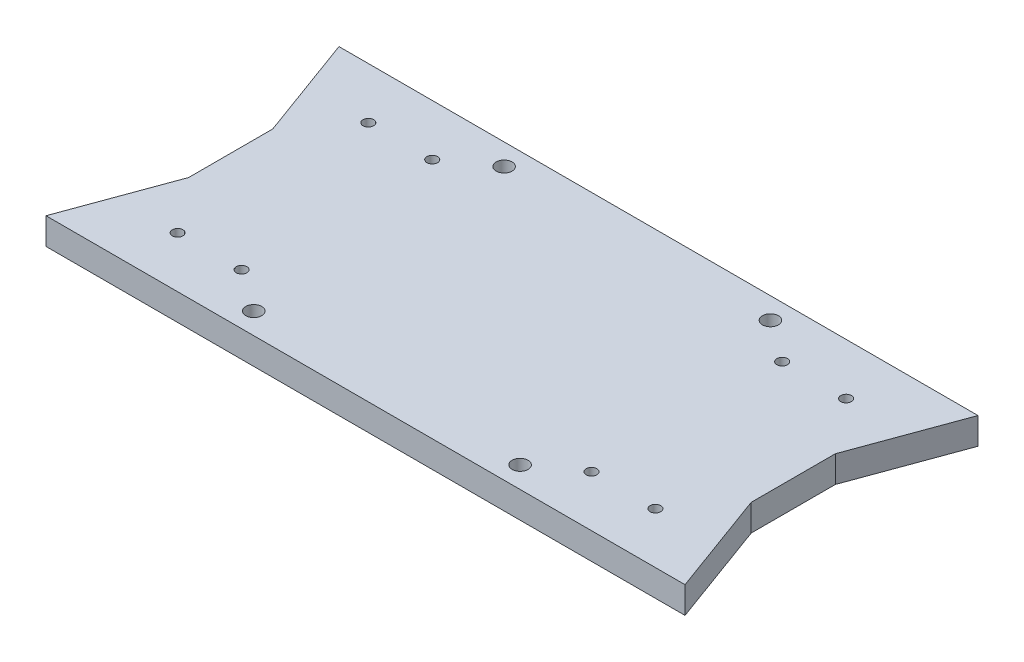
ISO-10303-21;
HEADER;
FILE_DESCRIPTION(('STEP AP214'),'2;1');
FILE_NAME('part.step','',(''),(''),'','','');
FILE_SCHEMA(('AUTOMOTIVE_DESIGN { 1 0 10303 214 1 1 1 1 }'));
ENDSEC;
DATA;
#1=APPLICATION_CONTEXT('core data for automotive mechanical design processes');
#2=APPLICATION_PROTOCOL_DEFINITION('international standard','automotive_design',2000,#1);
#3=PRODUCT_CONTEXT('',#1,'mechanical');
#4=PRODUCT('Part','Part','',(#3));
#5=PRODUCT_RELATED_PRODUCT_CATEGORY('part','',(#4));
#6=PRODUCT_DEFINITION_FORMATION('','',#4);
#7=PRODUCT_DEFINITION_CONTEXT('part definition',#1,'design');
#8=PRODUCT_DEFINITION('design','',#6,#7);
#9=PRODUCT_DEFINITION_SHAPE('','',#8);
#10=(LENGTH_UNIT() NAMED_UNIT(*) SI_UNIT(.MILLI.,.METRE.));
#11=(NAMED_UNIT(*) PLANE_ANGLE_UNIT() SI_UNIT($,.RADIAN.));
#12=(NAMED_UNIT(*) SI_UNIT($,.STERADIAN.) SOLID_ANGLE_UNIT());
#13=UNCERTAINTY_MEASURE_WITH_UNIT(LENGTH_MEASURE(1.E-05),#10,'distance_accuracy_value','');
#14=(GEOMETRIC_REPRESENTATION_CONTEXT(3) GLOBAL_UNCERTAINTY_ASSIGNED_CONTEXT((#13)) GLOBAL_UNIT_ASSIGNED_CONTEXT((#10,
#11,#12)) REPRESENTATION_CONTEXT('',''));
#15=CARTESIAN_POINT('',(0.,0.,0.));
#16=DIRECTION('',(0.,0.,1.));
#17=DIRECTION('',(1.,0.,0.));
#18=AXIS2_PLACEMENT_3D('',#15,#16,#17);
#19=CARTESIAN_POINT('',(-105.394952442636,6.35,-32.7826613509761));
#20=DIRECTION('',(-1.,0.,0.));
#21=DIRECTION('',(0.,0.,1.));
#22=AXIS2_PLACEMENT_3D('',#19,#20,#21);
#23=PLANE('',#22);
#24=DIRECTION('',(0.,0.,1.));
#25=VECTOR('',#24,1.);
#26=CARTESIAN_POINT('',(-105.394952442636,6.35,-32.7826613509761));
#27=LINE('',#26,#25);
#28=CARTESIAN_POINT('',(-105.394952442636,6.35,-77.7376613569761));
#29=VERTEX_POINT('',#28);
#30=CARTESIAN_POINT('',(-105.394952442636,6.35,-57.6776613449761));
#31=VERTEX_POINT('',#30);
#32=EDGE_CURVE('E99',#29,#31,#27,.T.);
#33=ORIENTED_EDGE('',*,*,#32,.F.);
#34=DIRECTION('',(0.,1.,0.));
#35=VECTOR('',#34,1.);
#36=CARTESIAN_POINT('',(-105.394952442636,0.,-77.7376613569761));
#37=LINE('',#36,#35);
#38=CARTESIAN_POINT('',(-105.394952442636,0.,-77.7376613569761));
#39=VERTEX_POINT('',#38);
#40=EDGE_CURVE('E128',#39,#29,#37,.T.);
#41=ORIENTED_EDGE('',*,*,#40,.F.);
#42=DIRECTION('',(0.,0.,-1.));
#43=VECTOR('',#42,1.);
#44=CARTESIAN_POINT('',(-105.394952442636,0.,-32.7826613509761));
#45=LINE('',#44,#43);
#46=CARTESIAN_POINT('',(-105.394952442636,0.,-57.6776613449761));
#47=VERTEX_POINT('',#46);
#48=EDGE_CURVE('E51',#47,#39,#45,.T.);
#49=ORIENTED_EDGE('',*,*,#48,.F.);
#50=DIRECTION('',(0.,1.,0.));
#51=VECTOR('',#50,1.);
#52=CARTESIAN_POINT('',(-105.394952442636,0.,-57.6776613449761));
#53=LINE('',#52,#51);
#54=EDGE_CURVE('E110',#47,#31,#53,.T.);
#55=ORIENTED_EDGE('',*,*,#54,.T.);
#56=EDGE_LOOP('',(#33,#41,#49,#55));
#57=FACE_BOUND('',#56,.T.);
#58=ADVANCED_FACE('F34',(#57),#23,.T.);
#59=CARTESIAN_POINT('',(0.,6.35,0.));
#60=DIRECTION('',(0.,-1.,0.));
#61=DIRECTION('',(0.,0.,-1.));
#62=AXIS2_PLACEMENT_3D('',#59,#60,#61);
#63=PLANE('',#62);
#64=CARTESIAN_POINT('',(-70.0586741186357,6.35,-97.5526613509762));
#65=DIRECTION('',(0.,1.,0.));
#66=DIRECTION('',(0.,0.,1.));
#67=AXIS2_PLACEMENT_3D('',#64,#65,#66);
#68=CIRCLE('',#67,1.90499999999999);
#69=CARTESIAN_POINT('',(-70.0586741186357,6.35,-95.6476613509762));
#70=VERTEX_POINT('',#69);
#71=EDGE_CURVE('E445',#70,#70,#68,.T.);
#72=ORIENTED_EDGE('',*,*,#71,.F.);
#73=EDGE_LOOP('',(#72));
#74=FACE_BOUND('',#73,.T.);
#75=CARTESIAN_POINT('',(-6.5586741186357,6.35,-97.5526613509762));
#76=DIRECTION('',(0.,1.,0.));
#77=DIRECTION('',(0.,0.,1.));
#78=AXIS2_PLACEMENT_3D('',#75,#76,#77);
#79=CIRCLE('',#78,1.90499999999999);
#80=CARTESIAN_POINT('',(-6.5586741186357,6.35,-95.6476613509762));
#81=VERTEX_POINT('',#80);
#82=EDGE_CURVE('E443',#81,#81,#79,.T.);
#83=ORIENTED_EDGE('',*,*,#82,.F.);
#84=EDGE_LOOP('',(#83));
#85=FACE_BOUND('',#84,.T.);
#86=CARTESIAN_POINT('',(-70.0586741186357,6.35,-37.8626613509762));
#87=DIRECTION('',(0.,1.,0.));
#88=DIRECTION('',(0.,0.,1.));
#89=AXIS2_PLACEMENT_3D('',#86,#87,#88);
#90=CIRCLE('',#89,1.90499999999999);
#91=CARTESIAN_POINT('',(-70.0586741186357,6.35,-35.9576613509762));
#92=VERTEX_POINT('',#91);
#93=EDGE_CURVE('E446',#92,#92,#90,.T.);
#94=ORIENTED_EDGE('',*,*,#93,.F.);
#95=EDGE_LOOP('',(#94));
#96=FACE_BOUND('',#95,.T.);
#97=CARTESIAN_POINT('',(-6.5586741186357,6.35,-37.8626613509762));
#98=DIRECTION('',(0.,1.,0.));
#99=DIRECTION('',(0.,0.,1.));
#100=AXIS2_PLACEMENT_3D('',#97,#98,#99);
#101=CIRCLE('',#100,1.90499999999999);
#102=CARTESIAN_POINT('',(-6.5586741186357,6.35,-35.9576613509762));
#103=VERTEX_POINT('',#102);
#104=EDGE_CURVE('E215',#103,#103,#101,.T.);
#105=ORIENTED_EDGE('',*,*,#104,.F.);
#106=EDGE_LOOP('',(#105));
#107=FACE_BOUND('',#106,.T.);
#108=ORIENTED_EDGE('',*,*,#32,.T.);
#109=DIRECTION('',(0.343774305183413,0.,-0.939052302641158));
#110=VECTOR('',#109,1.);
#111=CARTESIAN_POINT('',(-105.394952442636,6.35,-57.6776613449761));
#112=LINE('',#111,#110);
#113=CARTESIAN_POINT('',(-114.508674118636,6.35,-32.7826613509761));
#114=VERTEX_POINT('',#113);
#115=EDGE_CURVE('E103',#114,#31,#112,.T.);
#116=ORIENTED_EDGE('',*,*,#115,.F.);
#117=DIRECTION('',(1.,0.,0.));
#118=VECTOR('',#117,1.);
#119=CARTESIAN_POINT('',(-38.3336654810452,6.35,-32.7826613509761));
#120=LINE('',#119,#118);
#121=CARTESIAN_POINT('',(37.8413431565453,6.35,-32.7826613509761));
#122=VERTEX_POINT('',#121);
#123=EDGE_CURVE('E43',#114,#122,#120,.T.);
#124=ORIENTED_EDGE('',*,*,#123,.T.);
#125=DIRECTION('',(-0.343774305183413,0.,-0.939052302641158));
#126=VECTOR('',#125,1.);
#127=CARTESIAN_POINT('',(28.7276214805453,6.35,-57.6776613449761));
#128=LINE('',#127,#126);
#129=CARTESIAN_POINT('',(28.7276214805453,6.35,-57.6776613449761));
#130=VERTEX_POINT('',#129);
#131=EDGE_CURVE('E157',#122,#130,#128,.T.);
#132=ORIENTED_EDGE('',*,*,#131,.T.);
#133=DIRECTION('',(0.,0.,1.));
#134=VECTOR('',#133,1.);
#135=CARTESIAN_POINT('',(28.7276214805453,6.35,-32.7826613509761));
#136=LINE('',#135,#134);
#137=CARTESIAN_POINT('',(28.7276214805453,6.35,-77.7376613569761));
#138=VERTEX_POINT('',#137);
#139=EDGE_CURVE('E107',#138,#130,#136,.T.);
#140=ORIENTED_EDGE('',*,*,#139,.F.);
#141=DIRECTION('',(0.343774305183414,0.,-0.939052302641158));
#142=VECTOR('',#141,1.);
#143=CARTESIAN_POINT('',(37.8413431565453,6.35,-102.632661350976));
#144=LINE('',#143,#142);
#145=CARTESIAN_POINT('',(37.8413431565453,6.35,-102.632661350976));
#146=VERTEX_POINT('',#145);
#147=EDGE_CURVE('E166',#138,#146,#144,.T.);
#148=ORIENTED_EDGE('',*,*,#147,.T.);
#149=DIRECTION('',(-1.,0.,0.));
#150=VECTOR('',#149,1.);
#151=CARTESIAN_POINT('',(-38.3336654810452,6.35,-102.632661350976));
#152=LINE('',#151,#150);
#153=CARTESIAN_POINT('',(-114.508674118636,6.35,-102.632661350976));
#154=VERTEX_POINT('',#153);
#155=EDGE_CURVE('E11',#146,#154,#152,.T.);
#156=ORIENTED_EDGE('',*,*,#155,.T.);
#157=DIRECTION('',(-0.343774305183414,0.,-0.939052302641158));
#158=VECTOR('',#157,1.);
#159=CARTESIAN_POINT('',(-114.508674118636,6.35,-102.632661350976));
#160=LINE('',#159,#158);
#161=EDGE_CURVE('E105',#29,#154,#160,.T.);
#162=ORIENTED_EDGE('',*,*,#161,.F.);
#163=EDGE_LOOP('',(#108,#116,#124,#132,#140,#148,#156,#162));
#164=FACE_BOUND('',#163,.T.);
#165=CARTESIAN_POINT('',(18.6213431565454,6.35,-44.9476613509761));
#166=DIRECTION('',(0.,1.,0.));
#167=DIRECTION('',(0.,0.,1.));
#168=AXIS2_PLACEMENT_3D('',#165,#166,#167);
#169=CIRCLE('',#168,1.27);
#170=CARTESIAN_POINT('',(18.6213431565454,6.35,-43.6776613509761));
#171=VERTEX_POINT('',#170);
#172=EDGE_CURVE('E181',#171,#171,#169,.T.);
#173=ORIENTED_EDGE('',*,*,#172,.F.);
#174=EDGE_LOOP('',(#173));
#175=FACE_BOUND('',#174,.T.);
#176=CARTESIAN_POINT('',(3.38134315654538,6.35,-44.9476613509761));
#177=DIRECTION('',(0.,1.,0.));
#178=DIRECTION('',(0.,0.,1.));
#179=AXIS2_PLACEMENT_3D('',#176,#177,#178);
#180=CIRCLE('',#179,1.27);
#181=CARTESIAN_POINT('',(3.38134315654538,6.35,-43.6776613509761));
#182=VERTEX_POINT('',#181);
#183=EDGE_CURVE('E187',#182,#182,#180,.T.);
#184=ORIENTED_EDGE('',*,*,#183,.F.);
#185=EDGE_LOOP('',(#184));
#186=FACE_BOUND('',#185,.T.);
#187=CARTESIAN_POINT('',(18.6213431565454,6.35,-90.4076613509761));
#188=DIRECTION('',(0.,1.,0.));
#189=DIRECTION('',(0.,0.,1.));
#190=AXIS2_PLACEMENT_3D('',#187,#188,#189);
#191=CIRCLE('',#190,1.27000000000001);
#192=CARTESIAN_POINT('',(18.6213431565454,6.35,-89.137661350976));
#193=VERTEX_POINT('',#192);
#194=EDGE_CURVE('E193',#193,#193,#191,.T.);
#195=ORIENTED_EDGE('',*,*,#194,.F.);
#196=EDGE_LOOP('',(#195));
#197=FACE_BOUND('',#196,.T.);
#198=CARTESIAN_POINT('',(3.38134315654538,6.35,-90.4076613509761));
#199=DIRECTION('',(0.,1.,0.));
#200=DIRECTION('',(0.,0.,1.));
#201=AXIS2_PLACEMENT_3D('',#198,#199,#200);
#202=CIRCLE('',#201,1.27000000000001);
#203=CARTESIAN_POINT('',(3.38134315654538,6.35,-89.137661350976));
#204=VERTEX_POINT('',#203);
#205=EDGE_CURVE('E199',#204,#204,#202,.T.);
#206=ORIENTED_EDGE('',*,*,#205,.F.);
#207=EDGE_LOOP('',(#206));
#208=FACE_BOUND('',#207,.T.);
#209=CARTESIAN_POINT('',(-95.2886741186358,6.35,-44.9476613509761));
#210=DIRECTION('',(0.,-1.,0.));
#211=DIRECTION('',(0.,0.,1.));
#212=AXIS2_PLACEMENT_3D('',#209,#210,#211);
#213=CIRCLE('',#212,1.27);
#214=CARTESIAN_POINT('',(-95.2886741186358,6.35,-43.6776613509761));
#215=VERTEX_POINT('',#214);
#216=EDGE_CURVE('E133',#215,#215,#213,.T.);
#217=ORIENTED_EDGE('',*,*,#216,.T.);
#218=EDGE_LOOP('',(#217));
#219=FACE_BOUND('',#218,.T.);
#220=CARTESIAN_POINT('',(-80.0486741186358,6.35,-44.9476613509761));
#221=DIRECTION('',(0.,-1.,0.));
#222=DIRECTION('',(0.,0.,1.));
#223=AXIS2_PLACEMENT_3D('',#220,#221,#222);
#224=CIRCLE('',#223,1.27);
#225=CARTESIAN_POINT('',(-80.0486741186358,6.35,-43.6776613509761));
#226=VERTEX_POINT('',#225);
#227=EDGE_CURVE('E139',#226,#226,#224,.T.);
#228=ORIENTED_EDGE('',*,*,#227,.T.);
#229=EDGE_LOOP('',(#228));
#230=FACE_BOUND('',#229,.T.);
#231=CARTESIAN_POINT('',(-95.2886741186358,6.35,-90.4076613509761));
#232=DIRECTION('',(0.,-1.,0.));
#233=DIRECTION('',(0.,0.,1.));
#234=AXIS2_PLACEMENT_3D('',#231,#232,#233);
#235=CIRCLE('',#234,1.27000000000001);
#236=CARTESIAN_POINT('',(-95.2886741186358,6.35,-89.137661350976));
#237=VERTEX_POINT('',#236);
#238=EDGE_CURVE('E145',#237,#237,#235,.T.);
#239=ORIENTED_EDGE('',*,*,#238,.T.);
#240=EDGE_LOOP('',(#239));
#241=FACE_BOUND('',#240,.T.);
#242=CARTESIAN_POINT('',(-80.0486741186358,6.35,-90.4076613509761));
#243=DIRECTION('',(0.,-1.,0.));
#244=DIRECTION('',(0.,0.,1.));
#245=AXIS2_PLACEMENT_3D('',#242,#243,#244);
#246=CIRCLE('',#245,1.27000000000001);
#247=CARTESIAN_POINT('',(-80.0486741186358,6.35,-89.137661350976));
#248=VERTEX_POINT('',#247);
#249=EDGE_CURVE('E151',#248,#248,#246,.T.);
#250=ORIENTED_EDGE('',*,*,#249,.T.);
#251=EDGE_LOOP('',(#250));
#252=FACE_BOUND('',#251,.T.);
#253=ADVANCED_FACE('F100',(#74,#85,#96,#107,#164,#175,#186,#197,#208,#219,#230,#241,#252),#63,.F.);
#254=CARTESIAN_POINT('',(0.,0.,0.));
#255=DIRECTION('',(0.,-1.,0.));
#256=DIRECTION('',(0.,0.,-1.));
#257=AXIS2_PLACEMENT_3D('',#254,#255,#256);
#258=PLANE('',#257);
#259=CARTESIAN_POINT('',(-70.0586741186357,0.,-97.5526613509762));
#260=DIRECTION('',(0.,-1.,0.));
#261=DIRECTION('',(0.,0.,-1.));
#262=AXIS2_PLACEMENT_3D('',#259,#260,#261);
#263=CIRCLE('',#262,1.90499999999999);
#264=CARTESIAN_POINT('',(-70.0586741186357,0.,-99.4576613509762));
#265=VERTEX_POINT('',#264);
#266=EDGE_CURVE('E38',#265,#265,#263,.T.);
#267=ORIENTED_EDGE('',*,*,#266,.F.);
#268=EDGE_LOOP('',(#267));
#269=FACE_BOUND('',#268,.T.);
#270=CARTESIAN_POINT('',(-6.5586741186357,0.,-97.5526613509762));
#271=DIRECTION('',(0.,-1.,0.));
#272=DIRECTION('',(0.,0.,-1.));
#273=AXIS2_PLACEMENT_3D('',#270,#271,#272);
#274=CIRCLE('',#273,1.90499999999999);
#275=CARTESIAN_POINT('',(-6.5586741186357,0.,-99.4576613509762));
#276=VERTEX_POINT('',#275);
#277=EDGE_CURVE('E217',#276,#276,#274,.T.);
#278=ORIENTED_EDGE('',*,*,#277,.F.);
#279=EDGE_LOOP('',(#278));
#280=FACE_BOUND('',#279,.T.);
#281=CARTESIAN_POINT('',(-70.0586741186357,0.,-37.8626613509762));
#282=DIRECTION('',(0.,-1.,0.));
#283=DIRECTION('',(0.,0.,-1.));
#284=AXIS2_PLACEMENT_3D('',#281,#282,#283);
#285=CIRCLE('',#284,1.90499999999999);
#286=CARTESIAN_POINT('',(-70.0586741186357,0.,-39.7676613509762));
#287=VERTEX_POINT('',#286);
#288=EDGE_CURVE('E214',#287,#287,#285,.T.);
#289=ORIENTED_EDGE('',*,*,#288,.F.);
#290=EDGE_LOOP('',(#289));
#291=FACE_BOUND('',#290,.T.);
#292=CARTESIAN_POINT('',(-6.5586741186357,0.,-37.8626613509762));
#293=DIRECTION('',(0.,-1.,0.));
#294=DIRECTION('',(0.,0.,-1.));
#295=AXIS2_PLACEMENT_3D('',#292,#293,#294);
#296=CIRCLE('',#295,1.90499999999999);
#297=CARTESIAN_POINT('',(-6.5586741186357,0.,-39.7676613509762));
#298=VERTEX_POINT('',#297);
#299=EDGE_CURVE('E211',#298,#298,#296,.T.);
#300=ORIENTED_EDGE('',*,*,#299,.F.);
#301=EDGE_LOOP('',(#300));
#302=FACE_BOUND('',#301,.T.);
#303=CARTESIAN_POINT('',(3.38134315654538,0.,-44.9476613509761));
#304=DIRECTION('',(0.,1.,0.));
#305=DIRECTION('',(0.,0.,1.));
#306=AXIS2_PLACEMENT_3D('',#303,#304,#305);
#307=CIRCLE('',#306,1.27);
#308=CARTESIAN_POINT('',(3.38134315654538,0.,-43.6776613509761));
#309=VERTEX_POINT('',#308);
#310=EDGE_CURVE('E184',#309,#309,#307,.T.);
#311=ORIENTED_EDGE('',*,*,#310,.T.);
#312=EDGE_LOOP('',(#311));
#313=FACE_BOUND('',#312,.T.);
#314=CARTESIAN_POINT('',(3.38134315654538,0.,-90.4076613509761));
#315=DIRECTION('',(0.,1.,0.));
#316=DIRECTION('',(0.,0.,1.));
#317=AXIS2_PLACEMENT_3D('',#314,#315,#316);
#318=CIRCLE('',#317,1.27000000000001);
#319=CARTESIAN_POINT('',(3.38134315654538,0.,-89.137661350976));
#320=VERTEX_POINT('',#319);
#321=EDGE_CURVE('E196',#320,#320,#318,.T.);
#322=ORIENTED_EDGE('',*,*,#321,.T.);
#323=EDGE_LOOP('',(#322));
#324=FACE_BOUND('',#323,.T.);
#325=DIRECTION('',(1.,0.,0.));
#326=VECTOR('',#325,1.);
#327=CARTESIAN_POINT('',(-38.3336654810452,0.,-32.7826613509761));
#328=LINE('',#327,#326);
#329=CARTESIAN_POINT('',(-114.508674118636,0.,-32.7826613509761));
#330=VERTEX_POINT('',#329);
#331=CARTESIAN_POINT('',(37.8413431565453,0.,-32.7826613509761));
#332=VERTEX_POINT('',#331);
#333=EDGE_CURVE('E202',#330,#332,#328,.T.);
#334=ORIENTED_EDGE('',*,*,#333,.F.);
#335=DIRECTION('',(0.343774305183413,0.,-0.939052302641158));
#336=VECTOR('',#335,1.);
#337=CARTESIAN_POINT('',(-105.394952442636,0.,-57.6776613449761));
#338=LINE('',#337,#336);
#339=EDGE_CURVE('E114',#330,#47,#338,.T.);
#340=ORIENTED_EDGE('',*,*,#339,.T.);
#341=ORIENTED_EDGE('',*,*,#48,.T.);
#342=DIRECTION('',(-0.343774305183414,0.,-0.939052302641158));
#343=VECTOR('',#342,1.);
#344=CARTESIAN_POINT('',(-114.508674118636,0.,-102.632661350976));
#345=LINE('',#344,#343);
#346=CARTESIAN_POINT('',(-114.508674118636,0.,-102.632661350976));
#347=VERTEX_POINT('',#346);
#348=EDGE_CURVE('E124',#39,#347,#345,.T.);
#349=ORIENTED_EDGE('',*,*,#348,.T.);
#350=DIRECTION('',(-1.,0.,0.));
#351=VECTOR('',#350,1.);
#352=CARTESIAN_POINT('',(-38.3336654810452,0.,-102.632661350976));
#353=LINE('',#352,#351);
#354=CARTESIAN_POINT('',(37.8413431565453,0.,-102.632661350976));
#355=VERTEX_POINT('',#354);
#356=EDGE_CURVE('E205',#355,#347,#353,.T.);
#357=ORIENTED_EDGE('',*,*,#356,.F.);
#358=DIRECTION('',(0.343774305183414,0.,-0.939052302641158));
#359=VECTOR('',#358,1.);
#360=CARTESIAN_POINT('',(37.8413431565453,0.,-102.632661350976));
#361=LINE('',#360,#359);
#362=CARTESIAN_POINT('',(28.7276214805453,0.,-77.7376613569761));
#363=VERTEX_POINT('',#362);
#364=EDGE_CURVE('E169',#363,#355,#361,.T.);
#365=ORIENTED_EDGE('',*,*,#364,.F.);
#366=DIRECTION('',(0.,0.,-1.));
#367=VECTOR('',#366,1.);
#368=CARTESIAN_POINT('',(28.7276214805453,0.,-32.7826613509761));
#369=LINE('',#368,#367);
#370=CARTESIAN_POINT('',(28.7276214805453,0.,-57.6776613449761));
#371=VERTEX_POINT('',#370);
#372=EDGE_CURVE('E208',#371,#363,#369,.T.);
#373=ORIENTED_EDGE('',*,*,#372,.F.);
#374=DIRECTION('',(-0.343774305183413,0.,-0.939052302641158));
#375=VECTOR('',#374,1.);
#376=CARTESIAN_POINT('',(28.7276214805453,0.,-57.6776613449761));
#377=LINE('',#376,#375);
#378=EDGE_CURVE('E158',#332,#371,#377,.T.);
#379=ORIENTED_EDGE('',*,*,#378,.F.);
#380=EDGE_LOOP('',(#334,#340,#341,#349,#357,#365,#373,#379));
#381=FACE_BOUND('',#380,.T.);
#382=CARTESIAN_POINT('',(18.6213431565454,0.,-90.4076613509761));
#383=DIRECTION('',(0.,1.,0.));
#384=DIRECTION('',(0.,0.,1.));
#385=AXIS2_PLACEMENT_3D('',#382,#383,#384);
#386=CIRCLE('',#385,1.27000000000001);
#387=CARTESIAN_POINT('',(18.6213431565454,0.,-89.137661350976));
#388=VERTEX_POINT('',#387);
#389=EDGE_CURVE('E190',#388,#388,#386,.T.);
#390=ORIENTED_EDGE('',*,*,#389,.T.);
#391=EDGE_LOOP('',(#390));
#392=FACE_BOUND('',#391,.T.);
#393=CARTESIAN_POINT('',(18.6213431565454,0.,-44.9476613509761));
#394=DIRECTION('',(0.,1.,0.));
#395=DIRECTION('',(0.,0.,1.));
#396=AXIS2_PLACEMENT_3D('',#393,#394,#395);
#397=CIRCLE('',#396,1.27);
#398=CARTESIAN_POINT('',(18.6213431565454,0.,-43.6776613509761));
#399=VERTEX_POINT('',#398);
#400=EDGE_CURVE('E178',#399,#399,#397,.T.);
#401=ORIENTED_EDGE('',*,*,#400,.T.);
#402=EDGE_LOOP('',(#401));
#403=FACE_BOUND('',#402,.T.);
#404=CARTESIAN_POINT('',(-95.2886741186358,0.,-44.9476613509761));
#405=DIRECTION('',(0.,-1.,0.));
#406=DIRECTION('',(0.,0.,1.));
#407=AXIS2_PLACEMENT_3D('',#404,#405,#406);
#408=CIRCLE('',#407,1.27);
#409=CARTESIAN_POINT('',(-95.2886741186358,0.,-43.6776613509761));
#410=VERTEX_POINT('',#409);
#411=EDGE_CURVE('E130',#410,#410,#408,.T.);
#412=ORIENTED_EDGE('',*,*,#411,.F.);
#413=EDGE_LOOP('',(#412));
#414=FACE_BOUND('',#413,.T.);
#415=CARTESIAN_POINT('',(-80.0486741186358,0.,-44.9476613509761));
#416=DIRECTION('',(0.,-1.,0.));
#417=DIRECTION('',(0.,0.,1.));
#418=AXIS2_PLACEMENT_3D('',#415,#416,#417);
#419=CIRCLE('',#418,1.27);
#420=CARTESIAN_POINT('',(-80.0486741186358,0.,-43.6776613509761));
#421=VERTEX_POINT('',#420);
#422=EDGE_CURVE('E136',#421,#421,#419,.T.);
#423=ORIENTED_EDGE('',*,*,#422,.F.);
#424=EDGE_LOOP('',(#423));
#425=FACE_BOUND('',#424,.T.);
#426=CARTESIAN_POINT('',(-95.2886741186358,0.,-90.4076613509761));
#427=DIRECTION('',(0.,-1.,0.));
#428=DIRECTION('',(0.,0.,1.));
#429=AXIS2_PLACEMENT_3D('',#426,#427,#428);
#430=CIRCLE('',#429,1.27000000000001);
#431=CARTESIAN_POINT('',(-95.2886741186358,0.,-89.137661350976));
#432=VERTEX_POINT('',#431);
#433=EDGE_CURVE('E142',#432,#432,#430,.T.);
#434=ORIENTED_EDGE('',*,*,#433,.F.);
#435=EDGE_LOOP('',(#434));
#436=FACE_BOUND('',#435,.T.);
#437=CARTESIAN_POINT('',(-80.0486741186358,0.,-90.4076613509761));
#438=DIRECTION('',(0.,-1.,0.));
#439=DIRECTION('',(0.,0.,1.));
#440=AXIS2_PLACEMENT_3D('',#437,#438,#439);
#441=CIRCLE('',#440,1.27000000000001);
#442=CARTESIAN_POINT('',(-80.0486741186358,0.,-89.137661350976));
#443=VERTEX_POINT('',#442);
#444=EDGE_CURVE('E148',#443,#443,#441,.T.);
#445=ORIENTED_EDGE('',*,*,#444,.F.);
#446=EDGE_LOOP('',(#445));
#447=FACE_BOUND('',#446,.T.);
#448=ADVANCED_FACE('F227',(#269,#280,#291,#302,#313,#324,#381,#392,#403,#414,#425,#436,#447),
#258,.T.);
#449=CARTESIAN_POINT('',(-38.3336654810452,6.35,-32.7826613509761));
#450=DIRECTION('',(0.,0.,-1.));
#451=DIRECTION('',(-1.,0.,0.));
#452=AXIS2_PLACEMENT_3D('',#449,#450,#451);
#453=PLANE('',#452);
#454=ORIENTED_EDGE('',*,*,#333,.T.);
#455=DIRECTION('',(0.,1.,0.));
#456=VECTOR('',#455,1.);
#457=CARTESIAN_POINT('',(37.8413431565453,0.,-32.7826613509761));
#458=LINE('',#457,#456);
#459=EDGE_CURVE('E160',#332,#122,#458,.T.);
#460=ORIENTED_EDGE('',*,*,#459,.T.);
#461=ORIENTED_EDGE('',*,*,#123,.F.);
#462=DIRECTION('',(0.,1.,0.));
#463=VECTOR('',#462,1.);
#464=CARTESIAN_POINT('',(-114.508674118636,0.,-32.7826613509761));
#465=LINE('',#464,#463);
#466=EDGE_CURVE('E113',#330,#114,#465,.T.);
#467=ORIENTED_EDGE('',*,*,#466,.F.);
#468=EDGE_LOOP('',(#454,#460,#461,#467));
#469=FACE_BOUND('',#468,.T.);
#470=ADVANCED_FACE('F36',(#469),#453,.F.);
#471=CARTESIAN_POINT('',(28.7276214805453,6.35,-32.7826613509761));
#472=DIRECTION('',(-1.,0.,0.));
#473=DIRECTION('',(0.,0.,1.));
#474=AXIS2_PLACEMENT_3D('',#471,#472,#473);
#475=PLANE('',#474);
#476=DIRECTION('',(0.,1.,0.));
#477=VECTOR('',#476,1.);
#478=CARTESIAN_POINT('',(28.7276214805453,0.,-77.7376613569761));
#479=LINE('',#478,#477);
#480=EDGE_CURVE('E172',#363,#138,#479,.T.);
#481=ORIENTED_EDGE('',*,*,#480,.T.);
#482=ORIENTED_EDGE('',*,*,#139,.T.);
#483=DIRECTION('',(0.,1.,0.));
#484=VECTOR('',#483,1.);
#485=CARTESIAN_POINT('',(28.7276214805453,0.,-57.6776613449761));
#486=LINE('',#485,#484);
#487=EDGE_CURVE('E163',#371,#130,#486,.T.);
#488=ORIENTED_EDGE('',*,*,#487,.F.);
#489=ORIENTED_EDGE('',*,*,#372,.T.);
#490=EDGE_LOOP('',(#481,#482,#488,#489));
#491=FACE_BOUND('',#490,.T.);
#492=ADVANCED_FACE('F299',(#491),#475,.F.);
#493=CARTESIAN_POINT('',(-38.3336654810452,6.35,-102.632661350976));
#494=DIRECTION('',(0.,0.,1.));
#495=DIRECTION('',(1.,0.,0.));
#496=AXIS2_PLACEMENT_3D('',#493,#494,#495);
#497=PLANE('',#496);
#498=ORIENTED_EDGE('',*,*,#356,.T.);
#499=DIRECTION('',(0.,1.,0.));
#500=VECTOR('',#499,1.);
#501=CARTESIAN_POINT('',(-114.508674118636,0.,-102.632661350976));
#502=LINE('',#501,#500);
#503=EDGE_CURVE('E126',#347,#154,#502,.T.);
#504=ORIENTED_EDGE('',*,*,#503,.T.);
#505=ORIENTED_EDGE('',*,*,#155,.F.);
#506=DIRECTION('',(0.,1.,0.));
#507=VECTOR('',#506,1.);
#508=CARTESIAN_POINT('',(37.8413431565453,0.,-102.632661350976));
#509=LINE('',#508,#507);
#510=EDGE_CURVE('E175',#355,#146,#509,.T.);
#511=ORIENTED_EDGE('',*,*,#510,.F.);
#512=EDGE_LOOP('',(#498,#504,#505,#511));
#513=FACE_BOUND('',#512,.T.);
#514=ADVANCED_FACE('F295',(#513),#497,.F.);
#515=CARTESIAN_POINT('',(3.38134315654538,6.35,-90.4076613509761));
#516=DIRECTION('',(0.,-1.,0.));
#517=DIRECTION('',(0.,0.,-1.));
#518=AXIS2_PLACEMENT_3D('',#515,#516,#517);
#519=CYLINDRICAL_SURFACE('',#518,1.27000000000001);
#520=ORIENTED_EDGE('',*,*,#205,.T.);
#521=EDGE_LOOP('',(#520));
#522=FACE_BOUND('',#521,.T.);
#523=ORIENTED_EDGE('',*,*,#321,.F.);
#524=EDGE_LOOP('',(#523));
#525=FACE_BOUND('',#524,.T.);
#526=ADVANCED_FACE('F292',(#522,#525),#519,.F.);
#527=CARTESIAN_POINT('',(18.6213431565454,6.35,-90.4076613509761));
#528=DIRECTION('',(0.,-1.,0.));
#529=DIRECTION('',(0.,0.,-1.));
#530=AXIS2_PLACEMENT_3D('',#527,#528,#529);
#531=CYLINDRICAL_SURFACE('',#530,1.27000000000001);
#532=ORIENTED_EDGE('',*,*,#194,.T.);
#533=EDGE_LOOP('',(#532));
#534=FACE_BOUND('',#533,.T.);
#535=ORIENTED_EDGE('',*,*,#389,.F.);
#536=EDGE_LOOP('',(#535));
#537=FACE_BOUND('',#536,.T.);
#538=ADVANCED_FACE('F288',(#534,#537),#531,.F.);
#539=CARTESIAN_POINT('',(3.38134315654538,6.35,-44.9476613509761));
#540=DIRECTION('',(0.,-1.,0.));
#541=DIRECTION('',(0.,0.,-1.));
#542=AXIS2_PLACEMENT_3D('',#539,#540,#541);
#543=CYLINDRICAL_SURFACE('',#542,1.27);
#544=ORIENTED_EDGE('',*,*,#183,.T.);
#545=EDGE_LOOP('',(#544));
#546=FACE_BOUND('',#545,.T.);
#547=ORIENTED_EDGE('',*,*,#310,.F.);
#548=EDGE_LOOP('',(#547));
#549=FACE_BOUND('',#548,.T.);
#550=ADVANCED_FACE('F284',(#546,#549),#543,.F.);
#551=CARTESIAN_POINT('',(18.6213431565454,6.35,-44.9476613509761));
#552=DIRECTION('',(0.,-1.,0.));
#553=DIRECTION('',(0.,0.,-1.));
#554=AXIS2_PLACEMENT_3D('',#551,#552,#553);
#555=CYLINDRICAL_SURFACE('',#554,1.27);
#556=ORIENTED_EDGE('',*,*,#172,.T.);
#557=EDGE_LOOP('',(#556));
#558=FACE_BOUND('',#557,.T.);
#559=ORIENTED_EDGE('',*,*,#400,.F.);
#560=EDGE_LOOP('',(#559));
#561=FACE_BOUND('',#560,.T.);
#562=ADVANCED_FACE('F280',(#558,#561),#555,.F.);
#563=CARTESIAN_POINT('',(37.8413431565453,0.,-102.632661350976));
#564=DIRECTION('',(0.939052302641158,0.,0.343774305183414));
#565=DIRECTION('',(0.343774305183414,0.,-0.939052302641158));
#566=AXIS2_PLACEMENT_3D('',#563,#564,#565);
#567=PLANE('',#566);
#568=ORIENTED_EDGE('',*,*,#147,.F.);
#569=ORIENTED_EDGE('',*,*,#480,.F.);
#570=ORIENTED_EDGE('',*,*,#364,.T.);
#571=ORIENTED_EDGE('',*,*,#510,.T.);
#572=EDGE_LOOP('',(#568,#569,#570,#571));
#573=FACE_BOUND('',#572,.T.);
#574=ADVANCED_FACE('F266',(#573),#567,.T.);
#575=CARTESIAN_POINT('',(28.7276214805453,0.,-57.6776613449761));
#576=DIRECTION('',(0.939052302641158,0.,-0.343774305183413));
#577=DIRECTION('',(-0.343774305183413,0.,-0.939052302641158));
#578=AXIS2_PLACEMENT_3D('',#575,#576,#577);
#579=PLANE('',#578);
#580=ORIENTED_EDGE('',*,*,#131,.F.);
#581=ORIENTED_EDGE('',*,*,#459,.F.);
#582=ORIENTED_EDGE('',*,*,#378,.T.);
#583=ORIENTED_EDGE('',*,*,#487,.T.);
#584=EDGE_LOOP('',(#580,#581,#582,#583));
#585=FACE_BOUND('',#584,.T.);
#586=ADVANCED_FACE('F256',(#585),#579,.T.);
#587=CARTESIAN_POINT('',(-80.0486741186358,6.35,-90.4076613509761));
#588=DIRECTION('',(0.,-1.,0.));
#589=DIRECTION('',(0.,0.,-1.));
#590=AXIS2_PLACEMENT_3D('',#587,#588,#589);
#591=CYLINDRICAL_SURFACE('',#590,1.27000000000001);
#592=ORIENTED_EDGE('',*,*,#249,.F.);
#593=EDGE_LOOP('',(#592));
#594=FACE_BOUND('',#593,.T.);
#595=ORIENTED_EDGE('',*,*,#444,.T.);
#596=EDGE_LOOP('',(#595));
#597=FACE_BOUND('',#596,.T.);
#598=ADVANCED_FACE('F253',(#594,#597),#591,.F.);
#599=CARTESIAN_POINT('',(-95.2886741186358,6.35,-90.4076613509761));
#600=DIRECTION('',(0.,-1.,0.));
#601=DIRECTION('',(0.,0.,-1.));
#602=AXIS2_PLACEMENT_3D('',#599,#600,#601);
#603=CYLINDRICAL_SURFACE('',#602,1.27000000000001);
#604=ORIENTED_EDGE('',*,*,#238,.F.);
#605=EDGE_LOOP('',(#604));
#606=FACE_BOUND('',#605,.T.);
#607=ORIENTED_EDGE('',*,*,#433,.T.);
#608=EDGE_LOOP('',(#607));
#609=FACE_BOUND('',#608,.T.);
#610=ADVANCED_FACE('F255',(#606,#609),#603,.F.);
#611=CARTESIAN_POINT('',(-80.0486741186358,6.35,-44.9476613509761));
#612=DIRECTION('',(0.,-1.,0.));
#613=DIRECTION('',(0.,0.,-1.));
#614=AXIS2_PLACEMENT_3D('',#611,#612,#613);
#615=CYLINDRICAL_SURFACE('',#614,1.27);
#616=ORIENTED_EDGE('',*,*,#227,.F.);
#617=EDGE_LOOP('',(#616));
#618=FACE_BOUND('',#617,.T.);
#619=ORIENTED_EDGE('',*,*,#422,.T.);
#620=EDGE_LOOP('',(#619));
#621=FACE_BOUND('',#620,.T.);
#622=ADVANCED_FACE('F263',(#618,#621),#615,.F.);
#623=CARTESIAN_POINT('',(-95.2886741186358,6.35,-44.9476613509761));
#624=DIRECTION('',(0.,-1.,0.));
#625=DIRECTION('',(0.,0.,-1.));
#626=AXIS2_PLACEMENT_3D('',#623,#624,#625);
#627=CYLINDRICAL_SURFACE('',#626,1.27);
#628=ORIENTED_EDGE('',*,*,#216,.F.);
#629=EDGE_LOOP('',(#628));
#630=FACE_BOUND('',#629,.T.);
#631=ORIENTED_EDGE('',*,*,#411,.T.);
#632=EDGE_LOOP('',(#631));
#633=FACE_BOUND('',#632,.T.);
#634=ADVANCED_FACE('F320',(#630,#633),#627,.F.);
#635=CARTESIAN_POINT('',(-114.508674118636,0.,-102.632661350976));
#636=DIRECTION('',(0.939052302641158,0.,-0.343774305183414));
#637=DIRECTION('',(-0.343774305183414,0.,-0.939052302641158));
#638=AXIS2_PLACEMENT_3D('',#635,#636,#637);
#639=PLANE('',#638);
#640=ORIENTED_EDGE('',*,*,#161,.T.);
#641=ORIENTED_EDGE('',*,*,#503,.F.);
#642=ORIENTED_EDGE('',*,*,#348,.F.);
#643=ORIENTED_EDGE('',*,*,#40,.T.);
#644=EDGE_LOOP('',(#640,#641,#642,#643));
#645=FACE_BOUND('',#644,.T.);
#646=ADVANCED_FACE('F318',(#645),#639,.F.);
#647=CARTESIAN_POINT('',(-105.394952442636,0.,-57.6776613449761));
#648=DIRECTION('',(0.939052302641158,0.,0.343774305183413));
#649=DIRECTION('',(0.343774305183413,0.,-0.939052302641158));
#650=AXIS2_PLACEMENT_3D('',#647,#648,#649);
#651=PLANE('',#650);
#652=ORIENTED_EDGE('',*,*,#115,.T.);
#653=ORIENTED_EDGE('',*,*,#54,.F.);
#654=ORIENTED_EDGE('',*,*,#339,.F.);
#655=ORIENTED_EDGE('',*,*,#466,.T.);
#656=EDGE_LOOP('',(#652,#653,#654,#655));
#657=FACE_BOUND('',#656,.T.);
#658=ADVANCED_FACE('F117',(#657),#651,.F.);
#659=CARTESIAN_POINT('',(-6.5586741186357,-7.36600000000001,-37.8626613509762));
#660=DIRECTION('',(0.,1.,0.));
#661=DIRECTION('',(0.,0.,1.));
#662=AXIS2_PLACEMENT_3D('',#659,#660,#661);
#663=CYLINDRICAL_SURFACE('',#662,1.90499999999999);
#664=ORIENTED_EDGE('',*,*,#299,.T.);
#665=EDGE_LOOP('',(#664));
#666=FACE_BOUND('',#665,.T.);
#667=ORIENTED_EDGE('',*,*,#104,.T.);
#668=EDGE_LOOP('',(#667));
#669=FACE_BOUND('',#668,.T.);
#670=ADVANCED_FACE('F326',(#666,#669),#663,.F.);
#671=CARTESIAN_POINT('',(-70.0586741186357,-7.36600000000001,-37.8626613509762));
#672=DIRECTION('',(0.,1.,0.));
#673=DIRECTION('',(0.,0.,1.));
#674=AXIS2_PLACEMENT_3D('',#671,#672,#673);
#675=CYLINDRICAL_SURFACE('',#674,1.90499999999999);
#676=ORIENTED_EDGE('',*,*,#288,.T.);
#677=EDGE_LOOP('',(#676));
#678=FACE_BOUND('',#677,.T.);
#679=ORIENTED_EDGE('',*,*,#93,.T.);
#680=EDGE_LOOP('',(#679));
#681=FACE_BOUND('',#680,.T.);
#682=ADVANCED_FACE('F410',(#678,#681),#675,.F.);
#683=CARTESIAN_POINT('',(-6.5586741186357,-7.36600000000001,-97.5526613509762));
#684=DIRECTION('',(0.,1.,0.));
#685=DIRECTION('',(0.,0.,1.));
#686=AXIS2_PLACEMENT_3D('',#683,#684,#685);
#687=CYLINDRICAL_SURFACE('',#686,1.90499999999999);
#688=ORIENTED_EDGE('',*,*,#277,.T.);
#689=EDGE_LOOP('',(#688));
#690=FACE_BOUND('',#689,.T.);
#691=ORIENTED_EDGE('',*,*,#82,.T.);
#692=EDGE_LOOP('',(#691));
#693=FACE_BOUND('',#692,.T.);
#694=ADVANCED_FACE('F419',(#690,#693),#687,.F.);
#695=CARTESIAN_POINT('',(-70.0586741186357,-7.36600000000001,-97.5526613509762));
#696=DIRECTION('',(0.,1.,0.));
#697=DIRECTION('',(0.,0.,1.));
#698=AXIS2_PLACEMENT_3D('',#695,#696,#697);
#699=CYLINDRICAL_SURFACE('',#698,1.90499999999999);
#700=ORIENTED_EDGE('',*,*,#266,.T.);
#701=EDGE_LOOP('',(#700));
#702=FACE_BOUND('',#701,.T.);
#703=ORIENTED_EDGE('',*,*,#71,.T.);
#704=EDGE_LOOP('',(#703));
#705=FACE_BOUND('',#704,.T.);
#706=ADVANCED_FACE('F224',(#702,#705),#699,.F.);
#707=CLOSED_SHELL('',(#58,#253,#448,#470,#492,#514,#526,#538,#550,#562,#574,#586,#598,#610,#622,
#634,#646,#658,#670,#682,#694,#706));
#708=MANIFOLD_SOLID_BREP('B2',#707);
#709=ADVANCED_BREP_SHAPE_REPRESENTATION('',(#18,#708),#14);
#710=SHAPE_DEFINITION_REPRESENTATION(#9,#709);
ENDSEC;
END-ISO-10303-21;
